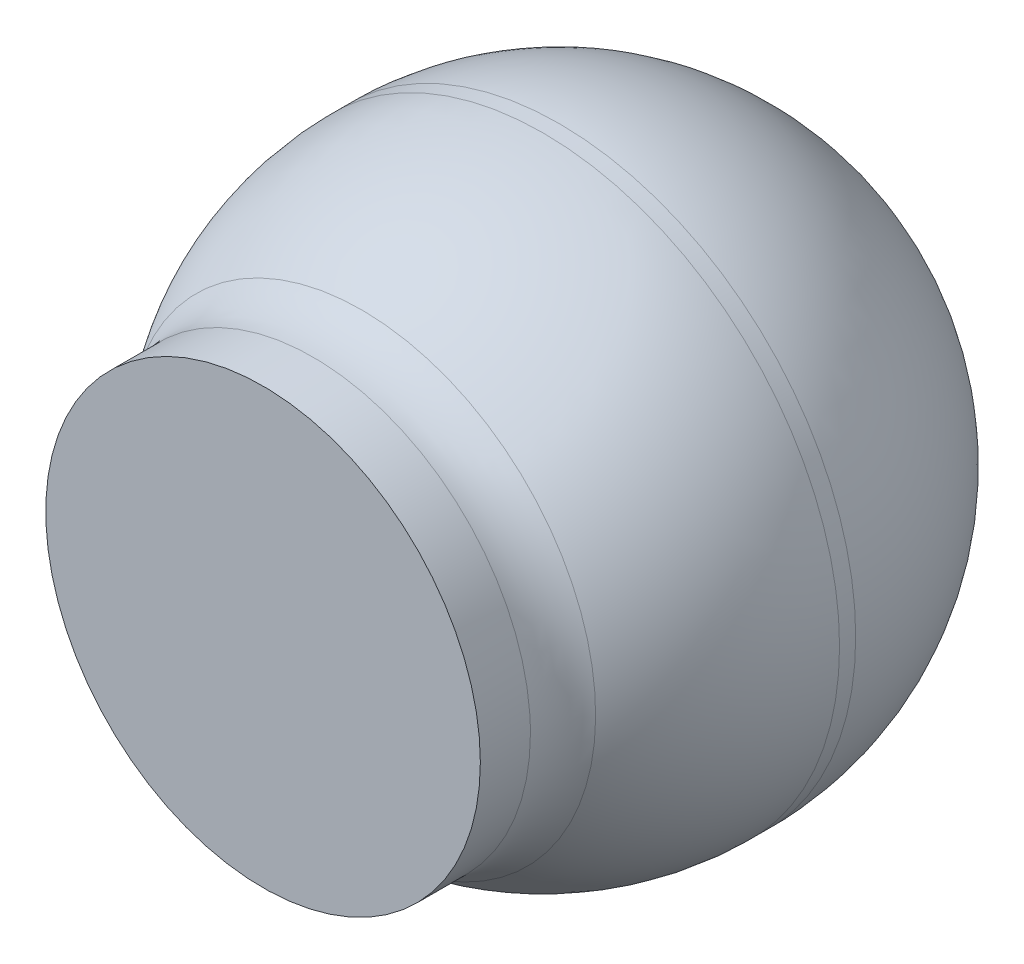
ISO-10303-21;
HEADER;
FILE_DESCRIPTION(('STEP AP214'),'2;1');
FILE_NAME('part.step','',(''),(''),'','','');
FILE_SCHEMA(('AUTOMOTIVE_DESIGN { 1 0 10303 214 1 1 1 1 }'));
ENDSEC;
DATA;
#1=APPLICATION_CONTEXT('core data for automotive mechanical design processes');
#2=APPLICATION_PROTOCOL_DEFINITION('international standard','automotive_design',2000,#1);
#3=PRODUCT_CONTEXT('',#1,'mechanical');
#4=PRODUCT('Part','Part','',(#3));
#5=PRODUCT_RELATED_PRODUCT_CATEGORY('part','',(#4));
#6=PRODUCT_DEFINITION_FORMATION('','',#4);
#7=PRODUCT_DEFINITION_CONTEXT('part definition',#1,'design');
#8=PRODUCT_DEFINITION('design','',#6,#7);
#9=PRODUCT_DEFINITION_SHAPE('','',#8);
#10=(LENGTH_UNIT() NAMED_UNIT(*) SI_UNIT(.MILLI.,.METRE.));
#11=(NAMED_UNIT(*) PLANE_ANGLE_UNIT() SI_UNIT($,.RADIAN.));
#12=(NAMED_UNIT(*) SI_UNIT($,.STERADIAN.) SOLID_ANGLE_UNIT());
#13=UNCERTAINTY_MEASURE_WITH_UNIT(LENGTH_MEASURE(1.E-05),#10,'distance_accuracy_value','');
#14=(GEOMETRIC_REPRESENTATION_CONTEXT(3) GLOBAL_UNCERTAINTY_ASSIGNED_CONTEXT((#13)) GLOBAL_UNIT_ASSIGNED_CONTEXT((#10,
#11,#12)) REPRESENTATION_CONTEXT('',''));
#15=CARTESIAN_POINT('',(0.,0.,0.));
#16=DIRECTION('',(0.,0.,1.));
#17=DIRECTION('',(1.,0.,0.));
#18=AXIS2_PLACEMENT_3D('',#15,#16,#17);
#19=CARTESIAN_POINT('',(-9.452919922269,-10.40134929145,10.006534503384));
#20=DIRECTION('',(0.,0.,-1.));
#21=DIRECTION('',(-1.,0.,0.));
#22=AXIS2_PLACEMENT_3D('',#19,#20,#21);
#23=PLANE('',#22);
#24=CARTESIAN_POINT('',(-9.452919922269,-10.40134929145,10.006534503384));
#25=DIRECTION('',(0.,0.,1.));
#26=DIRECTION('',(1.,0.,0.));
#27=AXIS2_PLACEMENT_3D('',#24,#25,#26);
#28=CIRCLE('',#27,0.275);
#29=CARTESIAN_POINT('',(-9.177919922269,-10.40134929145,10.006534503384));
#30=VERTEX_POINT('',#29);
#31=EDGE_CURVE('E20',#30,#30,#28,.F.);
#32=ORIENTED_EDGE('',*,*,#31,.F.);
#33=EDGE_LOOP('',(#32));
#34=FACE_BOUND('',#33,.T.);
#35=ADVANCED_FACE('F17',(#34),#23,.F.);
#36=CARTESIAN_POINT('',(-9.452919922269,-10.40134929145,9.906534503384));
#37=DIRECTION('',(0.,0.,1.));
#38=DIRECTION('',(1.,0.,0.));
#39=AXIS2_PLACEMENT_3D('',#36,#37,#38);
#40=CYLINDRICAL_SURFACE('',#39,0.275);
#41=CARTESIAN_POINT('',(-9.452919922269,-10.40134929145,9.943180457728));
#42=DIRECTION('',(0.,0.,-1.));
#43=DIRECTION('',(0.996700902337582,0.0811622527992467,0.));
#44=AXIS2_PLACEMENT_3D('',#41,#42,#43);
#45=CIRCLE('',#44,0.275000000000001);
#46=CARTESIAN_POINT('',(-9.17882717412617,-10.3790296719302,9.943180457728));
#47=VERTEX_POINT('',#46);
#48=EDGE_CURVE('E66',#47,#47,#45,.F.);
#49=ORIENTED_EDGE('',*,*,#48,.T.);
#50=EDGE_LOOP('',(#49));
#51=FACE_BOUND('',#50,.T.);
#52=ORIENTED_EDGE('',*,*,#31,.T.);
#53=EDGE_LOOP('',(#52));
#54=FACE_BOUND('',#53,.T.);
#55=ADVANCED_FACE('F62',(#51,#54),#40,.T.);
#56=CARTESIAN_POINT('',(-9.452919922269,-10.40134929145,9.943180457728));
#57=DIRECTION('',(0.,0.,-1.));
#58=DIRECTION('',(0.996700902337583,0.0811622527992448,0.));
#59=AXIS2_PLACEMENT_3D('',#56,#57,#58);
#60=TOROIDAL_SURFACE('',#59,0.375,0.1);
#61=ORIENTED_EDGE('',*,*,#48,.F.);
#62=EDGE_LOOP('',(#61));
#63=FACE_BOUND('',#62,.T.);
#64=CARTESIAN_POINT('',(-9.452919922269,-10.40134929145,9.881744931236));
#65=DIRECTION('',(0.,0.,-1.));
#66=DIRECTION('',(-0.99670090233869,-0.0811622527856417,0.));
#67=AXIS2_PLACEMENT_3D('',#64,#65,#66);
#68=CIRCLE('',#67,0.296097046412338);
#69=CARTESIAN_POINT('',(-9.748040115608,-10.42538119478,9.881744931236));
#70=VERTEX_POINT('',#69);
#71=EDGE_CURVE('E39',#70,#70,#68,.T.);
#72=ORIENTED_EDGE('',*,*,#71,.F.);
#73=EDGE_LOOP('',(#72));
#74=FACE_BOUND('',#73,.T.);
#75=ADVANCED_FACE('F57',(#63,#74),#60,.F.);
#76=CARTESIAN_POINT('',(-9.826682760645,-10.43178513625,9.651976062157));
#77=CARTESIAN_POINT('',(-9.826682760645,-10.43178513625,9.701461392103));
#78=CARTESIAN_POINT('',(-9.818526217348,-10.43112094157,9.750947004335));
#79=CARTESIAN_POINT('',(-9.802207085349,-10.42979205995,9.798626332798));
#80=CARTESIAN_POINT('',(-9.778341390838,-10.42784865493,9.842699544317));
#81=CARTESIAN_POINT('',(-9.748040115608,-10.42538119478,9.881744931236));
#82=(BOUNDED_CURVE() B_SPLINE_CURVE(5,(#76,#77,#78,#79,#80,#81),.UNSPECIFIED.,.F.,
.F.) B_SPLINE_CURVE_WITH_KNOTS((6,6),(0.,0.661568582165),
.UNSPECIFIED.) CURVE() GEOMETRIC_REPRESENTATION_ITEM() RATIONAL_B_SPLINE_CURVE((1.,1.,1.,1.,1.,1.)) REPRESENTATION_ITEM(''));
#83=CARTESIAN_POINT('',(-9.452919922269,-10.40134929145,9.651976062157));
#84=DIRECTION('',(0.,0.,-1.));
#85=AXIS1_PLACEMENT('',#83,#84);
#86=SURFACE_OF_REVOLUTION('',#82,#85);
#87=CARTESIAN_POINT('',(-9.452919922269,-10.40134929145,9.651976062157));
#88=DIRECTION('',(0.,0.,1.));
#89=DIRECTION('',(1.,0.,0.));
#90=AXIS2_PLACEMENT_3D('',#87,#88,#89);
#91=CIRCLE('',#90,0.375);
#92=CARTESIAN_POINT('',(-9.077919922269,-10.40134929145,9.651976062157));
#93=VERTEX_POINT('',#92);
#94=EDGE_CURVE('E36',#93,#93,#91,.F.);
#95=ORIENTED_EDGE('',*,*,#94,.F.);
#96=EDGE_LOOP('',(#95));
#97=FACE_BOUND('',#96,.T.);
#98=ORIENTED_EDGE('',*,*,#71,.T.);
#99=EDGE_LOOP('',(#98));
#100=FACE_BOUND('',#99,.T.);
#101=ADVANCED_FACE('F53',(#97,#100),#86,.F.);
#102=CARTESIAN_POINT('',(-9.452919922269,-10.40134929145,9.256534503384));
#103=DIRECTION('',(0.,0.,1.));
#104=DIRECTION('',(1.,0.,0.));
#105=AXIS2_PLACEMENT_3D('',#102,#103,#104);
#106=CYLINDRICAL_SURFACE('',#105,0.375);
#107=CARTESIAN_POINT('',(-9.452919922269,-10.40134929145,9.631534503384));
#108=DIRECTION('',(0.,0.,-1.));
#109=DIRECTION('',(0.0811622527992357,-0.996700902337583,0.));
#110=AXIS2_PLACEMENT_3D('',#107,#108,#109);
#111=CIRCLE('',#110,0.375);
#112=CARTESIAN_POINT('',(-9.42248407746929,-10.7751121298266,9.631534503384));
#113=VERTEX_POINT('',#112);
#114=CARTESIAN_POINT('',(-9.48335576706871,-10.0275864530734,9.631534503384));
#115=VERTEX_POINT('',#114);
#116=EDGE_CURVE('E11',#113,#115,#111,.T.);
#117=ORIENTED_EDGE('',*,*,#116,.F.);
#118=CARTESIAN_POINT('',(-9.45291992226901,-10.40134929145,9.631534503384));
#119=DIRECTION('',(0.,0.,1.));
#120=DIRECTION('',(0.0811622527992365,-0.996700902337583,0.));
#121=AXIS2_PLACEMENT_3D('',#118,#119,#120);
#122=CIRCLE('',#121,0.375);
#123=EDGE_CURVE('E25',#115,#113,#122,.F.);
#124=ORIENTED_EDGE('',*,*,#123,.F.);
#125=EDGE_LOOP('',(#117,#124));
#126=FACE_BOUND('',#125,.T.);
#127=ORIENTED_EDGE('',*,*,#94,.T.);
#128=EDGE_LOOP('',(#127));
#129=FACE_BOUND('',#128,.T.);
#130=ADVANCED_FACE('F34',(#126,#129),#106,.T.);
#131=CARTESIAN_POINT('',(-9.452919922269,-10.40134929145,9.631534503384));
#132=DIRECTION('',(0.0811622527992361,-0.996700902337583,0.));
#133=DIRECTION('',(-0.996700902337583,-0.0811622527992361,0.));
#134=AXIS2_PLACEMENT_3D('',#131,#132,#133);
#135=SPHERICAL_SURFACE('',#134,0.375);
#136=ORIENTED_EDGE('',*,*,#123,.T.);
#137=ORIENTED_EDGE('',*,*,#116,.T.);
#138=EDGE_LOOP('',(#136,#137));
#139=FACE_BOUND('',#138,.T.);
#140=ADVANCED_FACE('F32',(#139),#135,.T.);
#141=CLOSED_SHELL('',(#35,#55,#75,#101,#130,#140));
#142=MANIFOLD_SOLID_BREP('B1',#141);
#143=ADVANCED_BREP_SHAPE_REPRESENTATION('',(#18,#142),#14);
#144=SHAPE_DEFINITION_REPRESENTATION(#9,#143);
ENDSEC;
END-ISO-10303-21;
